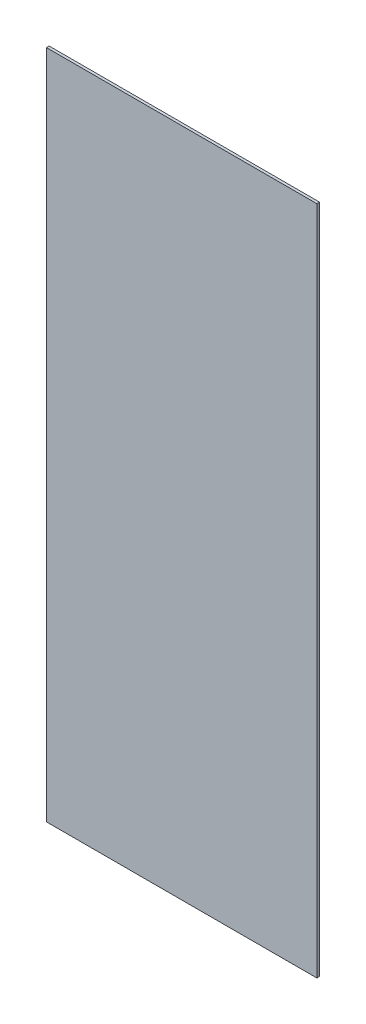
ISO-10303-21;
HEADER;
FILE_DESCRIPTION(('STEP AP214'),'2;1');
FILE_NAME('part.step','',(''),(''),'','','');
FILE_SCHEMA(('AUTOMOTIVE_DESIGN { 1 0 10303 214 1 1 1 1 }'));
ENDSEC;
DATA;
#1=APPLICATION_CONTEXT('core data for automotive mechanical design processes');
#2=APPLICATION_PROTOCOL_DEFINITION('international standard','automotive_design',2000,#1);
#3=PRODUCT_CONTEXT('',#1,'mechanical');
#4=PRODUCT('Part','Part','',(#3));
#5=PRODUCT_RELATED_PRODUCT_CATEGORY('part','',(#4));
#6=PRODUCT_DEFINITION_FORMATION('','',#4);
#7=PRODUCT_DEFINITION_CONTEXT('part definition',#1,'design');
#8=PRODUCT_DEFINITION('design','',#6,#7);
#9=PRODUCT_DEFINITION_SHAPE('','',#8);
#10=(LENGTH_UNIT() NAMED_UNIT(*) SI_UNIT(.MILLI.,.METRE.));
#11=(NAMED_UNIT(*) PLANE_ANGLE_UNIT() SI_UNIT($,.RADIAN.));
#12=(NAMED_UNIT(*) SI_UNIT($,.STERADIAN.) SOLID_ANGLE_UNIT());
#13=UNCERTAINTY_MEASURE_WITH_UNIT(LENGTH_MEASURE(1.E-05),#10,'distance_accuracy_value','');
#14=(GEOMETRIC_REPRESENTATION_CONTEXT(3) GLOBAL_UNCERTAINTY_ASSIGNED_CONTEXT((#13)) GLOBAL_UNIT_ASSIGNED_CONTEXT((#10,
#11,#12)) REPRESENTATION_CONTEXT('',''));
#15=CARTESIAN_POINT('',(0.,0.,0.));
#16=DIRECTION('',(0.,0.,1.));
#17=DIRECTION('',(1.,0.,0.));
#18=AXIS2_PLACEMENT_3D('',#15,#16,#17);
#19=CARTESIAN_POINT('',(0.,0.,0.));
#20=DIRECTION('',(0.,0.,-1.));
#21=DIRECTION('',(-1.,0.,0.));
#22=AXIS2_PLACEMENT_3D('',#19,#20,#21);
#23=PLANE('',#22);
#24=DIRECTION('',(0.,-1.,0.));
#25=VECTOR('',#24,1.);
#26=CARTESIAN_POINT('',(100.,248.,0.));
#27=LINE('',#26,#25);
#28=CARTESIAN_POINT('',(100.,248.,0.));
#29=VERTEX_POINT('',#28);
#30=CARTESIAN_POINT('',(100.,-248.,0.));
#31=VERTEX_POINT('',#30);
#32=EDGE_CURVE('E54',#29,#31,#27,.T.);
#33=ORIENTED_EDGE('',*,*,#32,.T.);
#34=DIRECTION('',(1.,0.,0.));
#35=VECTOR('',#34,1.);
#36=CARTESIAN_POINT('',(100.,-248.,0.));
#37=LINE('',#36,#35);
#38=CARTESIAN_POINT('',(-100.,-248.,0.));
#39=VERTEX_POINT('',#38);
#40=EDGE_CURVE('E75',#31,#39,#37,.F.);
#41=ORIENTED_EDGE('',*,*,#40,.T.);
#42=DIRECTION('',(0.,1.,0.));
#43=VECTOR('',#42,1.);
#44=CARTESIAN_POINT('',(-100.,248.,0.));
#45=LINE('',#44,#43);
#46=CARTESIAN_POINT('',(-100.,248.,0.));
#47=VERTEX_POINT('',#46);
#48=EDGE_CURVE('E57',#39,#47,#45,.T.);
#49=ORIENTED_EDGE('',*,*,#48,.T.);
#50=DIRECTION('',(1.,0.,0.));
#51=VECTOR('',#50,1.);
#52=CARTESIAN_POINT('',(100.,248.,0.));
#53=LINE('',#52,#51);
#54=EDGE_CURVE('E19',#47,#29,#53,.T.);
#55=ORIENTED_EDGE('',*,*,#54,.T.);
#56=EDGE_LOOP('',(#33,#41,#49,#55));
#57=FACE_BOUND('',#56,.T.);
#58=ADVANCED_FACE('F16',(#57),#23,.T.);
#59=CARTESIAN_POINT('',(100.,248.,2.));
#60=DIRECTION('',(0.,-1.,0.));
#61=DIRECTION('',(1.,0.,0.));
#62=AXIS2_PLACEMENT_3D('',#59,#60,#61);
#63=PLANE('',#62);
#64=DIRECTION('',(0.,0.,1.));
#65=VECTOR('',#64,1.);
#66=CARTESIAN_POINT('',(-100.,248.,2.));
#67=LINE('',#66,#65);
#68=CARTESIAN_POINT('',(-100.,248.,2.));
#69=VERTEX_POINT('',#68);
#70=EDGE_CURVE('E77',#47,#69,#67,.T.);
#71=ORIENTED_EDGE('',*,*,#70,.T.);
#72=DIRECTION('',(-1.,0.,0.));
#73=VECTOR('',#72,1.);
#74=CARTESIAN_POINT('',(0.,248.,2.));
#75=LINE('',#74,#73);
#76=CARTESIAN_POINT('',(100.,248.,2.));
#77=VERTEX_POINT('',#76);
#78=EDGE_CURVE('E72',#69,#77,#75,.F.);
#79=ORIENTED_EDGE('',*,*,#78,.T.);
#80=DIRECTION('',(0.,0.,1.));
#81=VECTOR('',#80,1.);
#82=CARTESIAN_POINT('',(100.,248.,2.));
#83=LINE('',#82,#81);
#84=EDGE_CURVE('E62',#77,#29,#83,.F.);
#85=ORIENTED_EDGE('',*,*,#84,.T.);
#86=ORIENTED_EDGE('',*,*,#54,.F.);
#87=EDGE_LOOP('',(#71,#79,#85,#86));
#88=FACE_BOUND('',#87,.T.);
#89=ADVANCED_FACE('F71',(#88),#63,.F.);
#90=CARTESIAN_POINT('',(100.,248.,2.));
#91=DIRECTION('',(-1.,0.,0.));
#92=DIRECTION('',(0.,-1.,0.));
#93=AXIS2_PLACEMENT_3D('',#90,#91,#92);
#94=PLANE('',#93);
#95=ORIENTED_EDGE('',*,*,#84,.F.);
#96=DIRECTION('',(0.,1.,0.));
#97=VECTOR('',#96,1.);
#98=CARTESIAN_POINT('',(100.,0.,2.));
#99=LINE('',#98,#97);
#100=CARTESIAN_POINT('',(100.,-248.,2.));
#101=VERTEX_POINT('',#100);
#102=EDGE_CURVE('E82',#77,#101,#99,.F.);
#103=ORIENTED_EDGE('',*,*,#102,.T.);
#104=DIRECTION('',(0.,0.,1.));
#105=VECTOR('',#104,1.);
#106=CARTESIAN_POINT('',(100.,-248.,2.));
#107=LINE('',#106,#105);
#108=EDGE_CURVE('E68',#101,#31,#107,.F.);
#109=ORIENTED_EDGE('',*,*,#108,.T.);
#110=ORIENTED_EDGE('',*,*,#32,.F.);
#111=EDGE_LOOP('',(#95,#103,#109,#110));
#112=FACE_BOUND('',#111,.T.);
#113=ADVANCED_FACE('F65',(#112),#94,.F.);
#114=CARTESIAN_POINT('',(100.,-248.,2.));
#115=DIRECTION('',(0.,1.,0.));
#116=DIRECTION('',(0.,0.,1.));
#117=AXIS2_PLACEMENT_3D('',#114,#115,#116);
#118=PLANE('',#117);
#119=ORIENTED_EDGE('',*,*,#108,.F.);
#120=DIRECTION('',(-1.,0.,0.));
#121=VECTOR('',#120,1.);
#122=CARTESIAN_POINT('',(0.,-248.,2.));
#123=LINE('',#122,#121);
#124=CARTESIAN_POINT('',(-100.,-248.,2.));
#125=VERTEX_POINT('',#124);
#126=EDGE_CURVE('E25',#101,#125,#123,.T.);
#127=ORIENTED_EDGE('',*,*,#126,.T.);
#128=DIRECTION('',(0.,0.,1.));
#129=VECTOR('',#128,1.);
#130=CARTESIAN_POINT('',(-100.,-248.,2.));
#131=LINE('',#130,#129);
#132=EDGE_CURVE('E33',#125,#39,#131,.F.);
#133=ORIENTED_EDGE('',*,*,#132,.T.);
#134=ORIENTED_EDGE('',*,*,#40,.F.);
#135=EDGE_LOOP('',(#119,#127,#133,#134));
#136=FACE_BOUND('',#135,.T.);
#137=ADVANCED_FACE('F87',(#136),#118,.F.);
#138=CARTESIAN_POINT('',(-100.,248.,2.));
#139=DIRECTION('',(1.,0.,0.));
#140=DIRECTION('',(0.,1.,0.));
#141=AXIS2_PLACEMENT_3D('',#138,#139,#140);
#142=PLANE('',#141);
#143=ORIENTED_EDGE('',*,*,#132,.F.);
#144=DIRECTION('',(0.,1.,0.));
#145=VECTOR('',#144,1.);
#146=CARTESIAN_POINT('',(-100.,0.,2.));
#147=LINE('',#146,#145);
#148=EDGE_CURVE('E11',#125,#69,#147,.T.);
#149=ORIENTED_EDGE('',*,*,#148,.T.);
#150=ORIENTED_EDGE('',*,*,#70,.F.);
#151=ORIENTED_EDGE('',*,*,#48,.F.);
#152=EDGE_LOOP('',(#143,#149,#150,#151));
#153=FACE_BOUND('',#152,.T.);
#154=ADVANCED_FACE('F90',(#153),#142,.F.);
#155=CARTESIAN_POINT('',(0.,0.,2.));
#156=DIRECTION('',(0.,0.,-1.));
#157=DIRECTION('',(-1.,0.,0.));
#158=AXIS2_PLACEMENT_3D('',#155,#156,#157);
#159=PLANE('',#158);
#160=ORIENTED_EDGE('',*,*,#126,.F.);
#161=ORIENTED_EDGE('',*,*,#102,.F.);
#162=ORIENTED_EDGE('',*,*,#78,.F.);
#163=ORIENTED_EDGE('',*,*,#148,.F.);
#164=EDGE_LOOP('',(#160,#161,#162,#163));
#165=FACE_BOUND('',#164,.T.);
#166=ADVANCED_FACE('F89',(#165),#159,.F.);
#167=CLOSED_SHELL('',(#58,#89,#113,#137,#154,#166));
#168=MANIFOLD_SOLID_BREP('B1',#167);
#169=ADVANCED_BREP_SHAPE_REPRESENTATION('',(#18,#168),#14);
#170=SHAPE_DEFINITION_REPRESENTATION(#9,#169);
ENDSEC;
END-ISO-10303-21;
